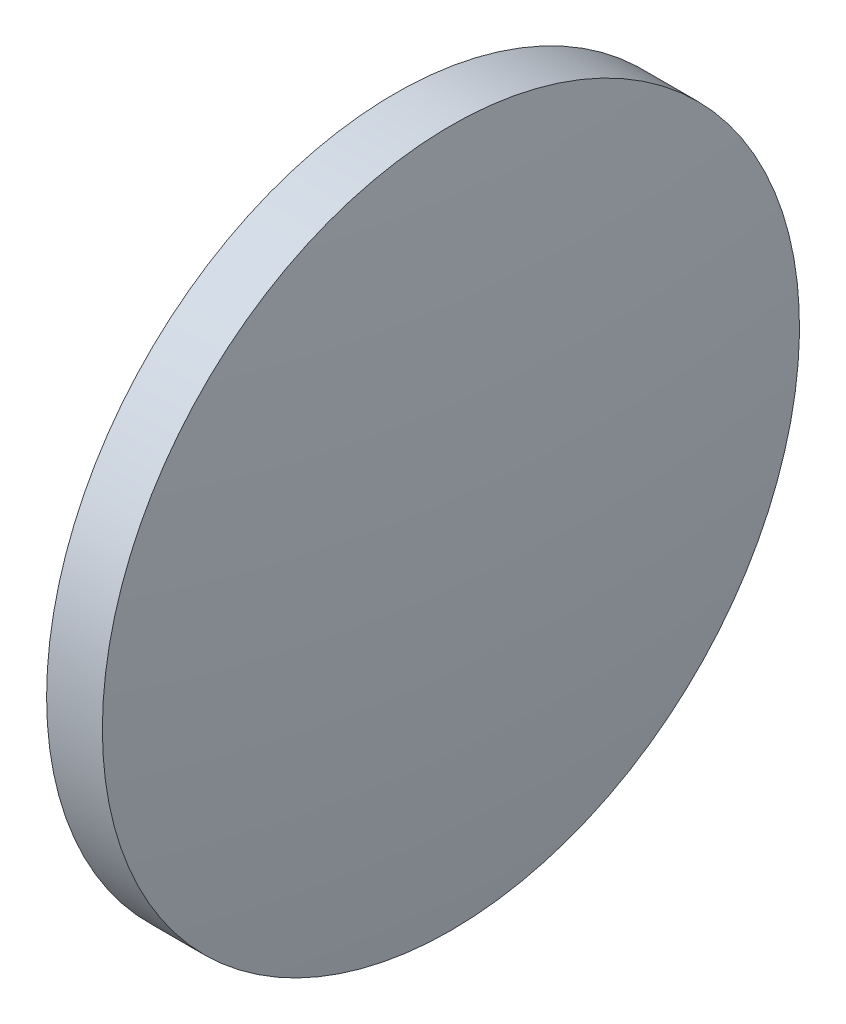
ISO-10303-21;
HEADER;
FILE_DESCRIPTION(('STEP AP214'),'2;1');
FILE_NAME('part.step','',(''),(''),'','','');
FILE_SCHEMA(('AUTOMOTIVE_DESIGN { 1 0 10303 214 1 1 1 1 }'));
ENDSEC;
DATA;
#1=APPLICATION_CONTEXT('core data for automotive mechanical design processes');
#2=APPLICATION_PROTOCOL_DEFINITION('international standard','automotive_design',2000,#1);
#3=PRODUCT_CONTEXT('',#1,'mechanical');
#4=PRODUCT('Part','Part','',(#3));
#5=PRODUCT_RELATED_PRODUCT_CATEGORY('part','',(#4));
#6=PRODUCT_DEFINITION_FORMATION('','',#4);
#7=PRODUCT_DEFINITION_CONTEXT('part definition',#1,'design');
#8=PRODUCT_DEFINITION('design','',#6,#7);
#9=PRODUCT_DEFINITION_SHAPE('','',#8);
#10=(LENGTH_UNIT() NAMED_UNIT(*) SI_UNIT(.MILLI.,.METRE.));
#11=(NAMED_UNIT(*) PLANE_ANGLE_UNIT() SI_UNIT($,.RADIAN.));
#12=(NAMED_UNIT(*) SI_UNIT($,.STERADIAN.) SOLID_ANGLE_UNIT());
#13=UNCERTAINTY_MEASURE_WITH_UNIT(LENGTH_MEASURE(1.E-05),#10,'distance_accuracy_value','');
#14=(GEOMETRIC_REPRESENTATION_CONTEXT(3) GLOBAL_UNCERTAINTY_ASSIGNED_CONTEXT((#13)) GLOBAL_UNIT_ASSIGNED_CONTEXT((#10,
#11,#12)) REPRESENTATION_CONTEXT('',''));
#15=CARTESIAN_POINT('',(0.,0.,0.));
#16=DIRECTION('',(0.,0.,1.));
#17=DIRECTION('',(1.,0.,0.));
#18=AXIS2_PLACEMENT_3D('',#15,#16,#17);
#19=CARTESIAN_POINT('',(303.031870459508,108.251348429447,0.));
#20=DIRECTION('',(-1.,0.,0.));
#21=DIRECTION('',(0.,-1.,0.));
#22=AXIS2_PLACEMENT_3D('',#19,#20,#21);
#23=SPHERICAL_SURFACE('',#22,103.176052631579);
#24=CARTESIAN_POINT('',(405.447923091087,108.251348429447,0.));
#25=DIRECTION('',(-1.,0.,0.));
#26=DIRECTION('',(0.,0.,1.));
#27=AXIS2_PLACEMENT_3D('',#24,#25,#26);
#28=CIRCLE('',#27,12.5);
#29=CARTESIAN_POINT('',(405.447923091087,108.251348429447,12.5));
#30=VERTEX_POINT('',#29);
#31=EDGE_CURVE('E10',#30,#30,#28,.T.);
#32=ORIENTED_EDGE('',*,*,#31,.F.);
#33=EDGE_LOOP('',(#32));
#34=FACE_BOUND('',#33,.T.);
#35=ADVANCED_FACE('F35',(#34),#23,.T.);
#36=CARTESIAN_POINT('',(401.082307188326,108.251348429447,0.));
#37=DIRECTION('',(-1.,0.,0.));
#38=DIRECTION('',(0.,0.,1.));
#39=AXIS2_PLACEMENT_3D('',#36,#37,#38);
#40=CYLINDRICAL_SURFACE('',#39,12.5);
#41=CARTESIAN_POINT('',(403.447923091087,108.251348429447,0.));
#42=DIRECTION('',(-1.,0.,0.));
#43=DIRECTION('',(0.,0.,1.));
#44=AXIS2_PLACEMENT_3D('',#41,#42,#43);
#45=CIRCLE('',#44,12.5);
#46=CARTESIAN_POINT('',(403.447923091087,108.251348429447,12.5));
#47=VERTEX_POINT('',#46);
#48=EDGE_CURVE('E41',#47,#47,#45,.T.);
#49=ORIENTED_EDGE('',*,*,#48,.F.);
#50=EDGE_LOOP('',(#49));
#51=FACE_BOUND('',#50,.T.);
#52=ORIENTED_EDGE('',*,*,#31,.T.);
#53=EDGE_LOOP('',(#52));
#54=FACE_BOUND('',#53,.T.);
#55=ADVANCED_FACE('F49',(#51,#54),#40,.T.);
#56=CARTESIAN_POINT('',(403.447923091087,108.251348429447,0.));
#57=DIRECTION('',(1.,0.,0.));
#58=DIRECTION('',(0.,0.,-1.));
#59=AXIS2_PLACEMENT_3D('',#56,#57,#58);
#60=PLANE('',#59);
#61=ORIENTED_EDGE('',*,*,#48,.T.);
#62=EDGE_LOOP('',(#61));
#63=FACE_BOUND('',#62,.T.);
#64=ADVANCED_FACE('F47',(#63),#60,.F.);
#65=CLOSED_SHELL('',(#35,#55,#64));
#66=MANIFOLD_SOLID_BREP('B2',#65);
#67=ADVANCED_BREP_SHAPE_REPRESENTATION('',(#18,#66),#14);
#68=SHAPE_DEFINITION_REPRESENTATION(#9,#67);
ENDSEC;
END-ISO-10303-21;
